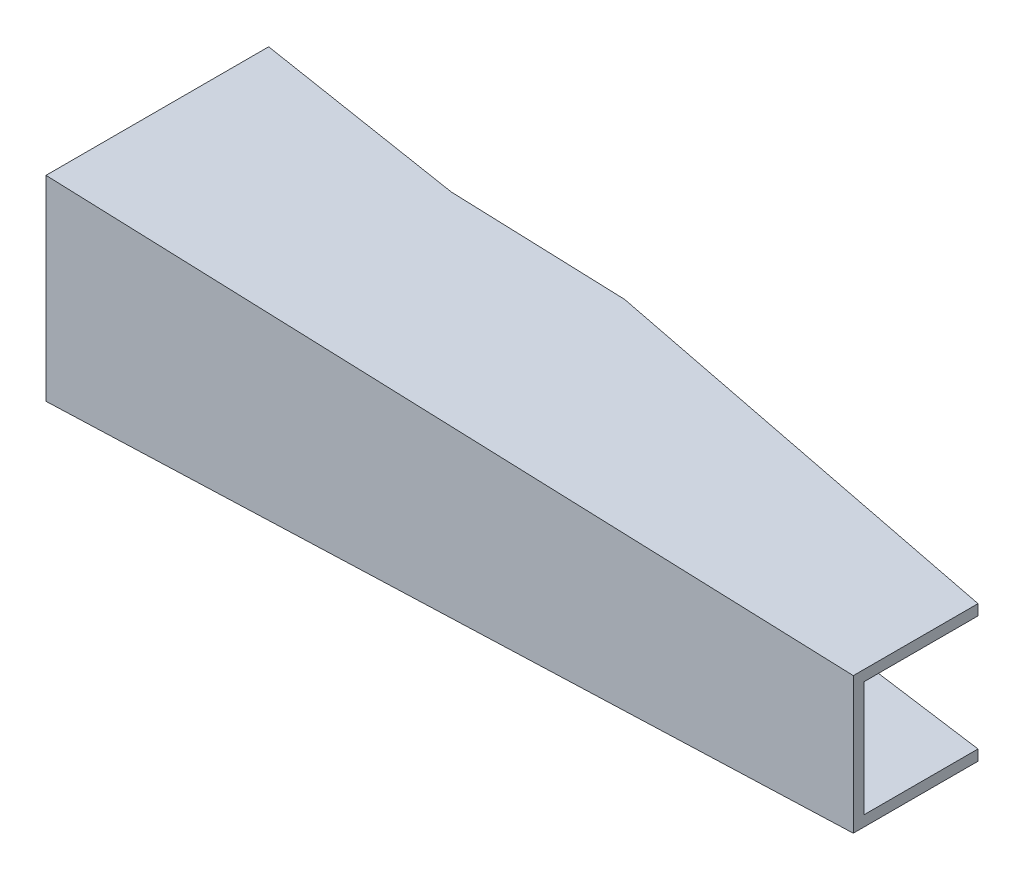
ISO-10303-21;
HEADER;
FILE_DESCRIPTION(('STEP AP214'),'2;1');
FILE_NAME('part.step','',(''),(''),'','','');
FILE_SCHEMA(('AUTOMOTIVE_DESIGN { 1 0 10303 214 1 1 1 1 }'));
ENDSEC;
DATA;
#1=APPLICATION_CONTEXT('core data for automotive mechanical design processes');
#2=APPLICATION_PROTOCOL_DEFINITION('international standard','automotive_design',2000,#1);
#3=PRODUCT_CONTEXT('',#1,'mechanical');
#4=PRODUCT('Part','Part','',(#3));
#5=PRODUCT_RELATED_PRODUCT_CATEGORY('part','',(#4));
#6=PRODUCT_DEFINITION_FORMATION('','',#4);
#7=PRODUCT_DEFINITION_CONTEXT('part definition',#1,'design');
#8=PRODUCT_DEFINITION('design','',#6,#7);
#9=PRODUCT_DEFINITION_SHAPE('','',#8);
#10=(LENGTH_UNIT() NAMED_UNIT(*) SI_UNIT(.MILLI.,.METRE.));
#11=(NAMED_UNIT(*) PLANE_ANGLE_UNIT() SI_UNIT($,.RADIAN.));
#12=(NAMED_UNIT(*) SI_UNIT($,.STERADIAN.) SOLID_ANGLE_UNIT());
#13=UNCERTAINTY_MEASURE_WITH_UNIT(LENGTH_MEASURE(1.E-05),#10,'distance_accuracy_value','');
#14=(GEOMETRIC_REPRESENTATION_CONTEXT(3) GLOBAL_UNCERTAINTY_ASSIGNED_CONTEXT((#13)) GLOBAL_UNIT_ASSIGNED_CONTEXT((#10,
#11,#12)) REPRESENTATION_CONTEXT('',''));
#15=CARTESIAN_POINT('',(0.,0.,0.));
#16=DIRECTION('',(0.,0.,1.));
#17=DIRECTION('',(1.,0.,0.));
#18=AXIS2_PLACEMENT_3D('',#15,#16,#17);
#19=CARTESIAN_POINT('',(326.3,-27.585,105.));
#20=DIRECTION('',(-1.,0.,0.));
#21=DIRECTION('',(0.,0.,1.));
#22=AXIS2_PLACEMENT_3D('',#19,#20,#21);
#23=PLANE('',#22);
#24=DIRECTION('',(0.,0.,1.));
#25=VECTOR('',#24,1.);
#26=CARTESIAN_POINT('',(326.3,23.285,100.7));
#27=LINE('',#26,#25);
#28=CARTESIAN_POINT('',(326.3,23.285,54.6));
#29=VERTEX_POINT('',#28);
#30=CARTESIAN_POINT('',(326.3,23.285,100.7));
#31=VERTEX_POINT('',#30);
#32=EDGE_CURVE('E138',#29,#31,#27,.T.);
#33=ORIENTED_EDGE('',*,*,#32,.F.);
#34=DIRECTION('',(0.,-1.,0.));
#35=VECTOR('',#34,1.);
#36=CARTESIAN_POINT('',(326.3,105.1,54.6));
#37=LINE('',#36,#35);
#38=CARTESIAN_POINT('',(326.3,27.585,54.6));
#39=VERTEX_POINT('',#38);
#40=EDGE_CURVE('E222',#39,#29,#37,.T.);
#41=ORIENTED_EDGE('',*,*,#40,.F.);
#42=DIRECTION('',(0.,0.,-1.));
#43=VECTOR('',#42,1.);
#44=CARTESIAN_POINT('',(326.3,27.585,105.));
#45=LINE('',#44,#43);
#46=CARTESIAN_POINT('',(326.3,27.585,105.));
#47=VERTEX_POINT('',#46);
#48=EDGE_CURVE('E211',#47,#39,#45,.T.);
#49=ORIENTED_EDGE('',*,*,#48,.F.);
#50=DIRECTION('',(0.,1.,0.));
#51=VECTOR('',#50,1.);
#52=CARTESIAN_POINT('',(326.3,-27.585,105.));
#53=LINE('',#52,#51);
#54=CARTESIAN_POINT('',(326.3,-27.585,105.));
#55=VERTEX_POINT('',#54);
#56=EDGE_CURVE('E193',#55,#47,#53,.T.);
#57=ORIENTED_EDGE('',*,*,#56,.F.);
#58=DIRECTION('',(0.,0.,-1.));
#59=VECTOR('',#58,1.);
#60=CARTESIAN_POINT('',(326.3,-27.585,105.));
#61=LINE('',#60,#59);
#62=CARTESIAN_POINT('',(326.3,-27.585,54.6));
#63=VERTEX_POINT('',#62);
#64=EDGE_CURVE('E202',#55,#63,#61,.T.);
#65=ORIENTED_EDGE('',*,*,#64,.T.);
#66=CARTESIAN_POINT('',(326.3,-23.285,54.6));
#67=VERTEX_POINT('',#66);
#68=EDGE_CURVE('E71',#67,#63,#37,.T.);
#69=ORIENTED_EDGE('',*,*,#68,.F.);
#70=DIRECTION('',(0.,0.,-1.));
#71=VECTOR('',#70,1.);
#72=CARTESIAN_POINT('',(326.3,-23.285,100.7));
#73=LINE('',#72,#71);
#74=CARTESIAN_POINT('',(326.3,-23.285,100.7));
#75=VERTEX_POINT('',#74);
#76=EDGE_CURVE('E64',#75,#67,#73,.T.);
#77=ORIENTED_EDGE('',*,*,#76,.F.);
#78=DIRECTION('',(0.,-1.,0.));
#79=VECTOR('',#78,1.);
#80=CARTESIAN_POINT('',(326.3,23.285,100.7));
#81=LINE('',#80,#79);
#82=EDGE_CURVE('E151',#31,#75,#81,.T.);
#83=ORIENTED_EDGE('',*,*,#82,.F.);
#84=EDGE_LOOP('',(#33,#41,#49,#57,#65,#69,#77,#83));
#85=FACE_BOUND('',#84,.T.);
#86=ADVANCED_FACE('F48',(#85),#23,.F.);
#87=CARTESIAN_POINT('',(0.,39.555,105.));
#88=DIRECTION('',(1.,0.,0.));
#89=DIRECTION('',(0.,1.,0.));
#90=AXIS2_PLACEMENT_3D('',#87,#88,#89);
#91=PLANE('',#90);
#92=DIRECTION('',(0.,0.,-1.));
#93=VECTOR('',#92,1.);
#94=CARTESIAN_POINT('',(0.,35.255,-10.9565275072));
#95=LINE('',#94,#93);
#96=CARTESIAN_POINT('',(0.,35.255,100.7));
#97=VERTEX_POINT('',#96);
#98=CARTESIAN_POINT('',(0.,35.255,15.));
#99=VERTEX_POINT('',#98);
#100=EDGE_CURVE('E166',#97,#99,#95,.T.);
#101=ORIENTED_EDGE('',*,*,#100,.F.);
#102=DIRECTION('',(0.,1.,0.));
#103=VECTOR('',#102,1.);
#104=CARTESIAN_POINT('',(0.,35.255,100.7));
#105=LINE('',#104,#103);
#106=CARTESIAN_POINT('',(0.,-35.255,100.7));
#107=VERTEX_POINT('',#106);
#108=EDGE_CURVE('E153',#107,#97,#105,.T.);
#109=ORIENTED_EDGE('',*,*,#108,.F.);
#110=DIRECTION('',(0.,0.,1.));
#111=VECTOR('',#110,1.);
#112=CARTESIAN_POINT('',(0.,-35.255,-10.9565275072));
#113=LINE('',#112,#111);
#114=CARTESIAN_POINT('',(0.,-35.255,15.));
#115=VERTEX_POINT('',#114);
#116=EDGE_CURVE('E172',#115,#107,#113,.T.);
#117=ORIENTED_EDGE('',*,*,#116,.F.);
#118=DIRECTION('',(0.,-1.,0.));
#119=VECTOR('',#118,1.);
#120=CARTESIAN_POINT('',(0.,105.1,15.));
#121=LINE('',#120,#119);
#122=CARTESIAN_POINT('',(0.,-39.555,15.));
#123=VERTEX_POINT('',#122);
#124=EDGE_CURVE('E176',#115,#123,#121,.T.);
#125=ORIENTED_EDGE('',*,*,#124,.T.);
#126=DIRECTION('',(0.,0.,-1.));
#127=VECTOR('',#126,1.);
#128=CARTESIAN_POINT('',(0.,-39.555,105.));
#129=LINE('',#128,#127);
#130=CARTESIAN_POINT('',(0.,-39.555,105.));
#131=VERTEX_POINT('',#130);
#132=EDGE_CURVE('E205',#131,#123,#129,.T.);
#133=ORIENTED_EDGE('',*,*,#132,.F.);
#134=DIRECTION('',(0.,-1.,0.));
#135=VECTOR('',#134,1.);
#136=CARTESIAN_POINT('',(0.,39.555,105.));
#137=LINE('',#136,#135);
#138=CARTESIAN_POINT('',(0.,39.555,105.));
#139=VERTEX_POINT('',#138);
#140=EDGE_CURVE('E198',#139,#131,#137,.T.);
#141=ORIENTED_EDGE('',*,*,#140,.F.);
#142=DIRECTION('',(0.,0.,-1.));
#143=VECTOR('',#142,1.);
#144=CARTESIAN_POINT('',(0.,39.555,105.));
#145=LINE('',#144,#143);
#146=CARTESIAN_POINT('',(0.,39.555,15.));
#147=VERTEX_POINT('',#146);
#148=EDGE_CURVE('E208',#139,#147,#145,.T.);
#149=ORIENTED_EDGE('',*,*,#148,.T.);
#150=EDGE_CURVE('E179',#147,#99,#121,.T.);
#151=ORIENTED_EDGE('',*,*,#150,.T.);
#152=EDGE_LOOP('',(#101,#109,#117,#125,#133,#141,#149,#151));
#153=FACE_BOUND('',#152,.T.);
#154=ADVANCED_FACE('F273',(#153),#91,.F.);
#155=CARTESIAN_POINT('',(0.,105.1,15.));
#156=DIRECTION('',(0.126715247143414,0.,-0.991939134292716));
#157=DIRECTION('',(-0.991939134292716,0.,-0.126715247143414));
#158=AXIS2_PLACEMENT_3D('',#155,#156,#157);
#159=PLANE('',#158);
#160=DIRECTION('',(0.,-1.,0.));
#161=VECTOR('',#160,1.);
#162=CARTESIAN_POINT('',(84.7,105.1,25.82));
#163=LINE('',#162,#161);
#164=CARTESIAN_POINT('',(84.7,36.4478623965676,25.82));
#165=VERTEX_POINT('',#164);
#166=CARTESIAN_POINT('',(84.7,32.1478623965676,25.82));
#167=VERTEX_POINT('',#166);
#168=EDGE_CURVE('E180',#165,#167,#163,.T.);
#169=ORIENTED_EDGE('',*,*,#168,.T.);
#170=DIRECTION('',(-0.991283067279321,0.036364260849934,-0.126631437874407));
#171=VECTOR('',#170,1.);
#172=CARTESIAN_POINT('',(-2.51772199464138,35.3473601969839,14.6783736483823));
#173=LINE('',#172,#171);
#174=EDGE_CURVE('E259',#167,#99,#173,.T.);
#175=ORIENTED_EDGE('',*,*,#174,.T.);
#176=ORIENTED_EDGE('',*,*,#150,.F.);
#177=DIRECTION('',(0.991283067279321,-0.036364260849934,0.126631437874407));
#178=VECTOR('',#177,1.);
#179=CARTESIAN_POINT('',(332.365093492241,27.3625079095859,57.4579729821257));
#180=LINE('',#179,#178);
#181=EDGE_CURVE('E191',#147,#165,#180,.T.);
#182=ORIENTED_EDGE('',*,*,#181,.T.);
#183=EDGE_LOOP('',(#169,#175,#176,#182));
#184=FACE_BOUND('',#183,.T.);
#185=ADVANCED_FACE('F269',(#184),#159,.T.);
#186=ORIENTED_EDGE('',*,*,#124,.F.);
#187=DIRECTION('',(0.991283067279321,0.036364260849934,0.126631437874407));
#188=VECTOR('',#187,1.);
#189=CARTESIAN_POINT('',(5.05941542784582,-35.0694002369865,15.6463149342301));
#190=LINE('',#189,#188);
#191=CARTESIAN_POINT('',(84.7,-32.1478623965676,25.82));
#192=VERTEX_POINT('',#191);
#193=EDGE_CURVE('E255',#115,#192,#190,.T.);
#194=ORIENTED_EDGE('',*,*,#193,.T.);
#195=CARTESIAN_POINT('',(84.7,-36.4478623965676,25.82));
#196=VERTEX_POINT('',#195);
#197=EDGE_CURVE('E234',#192,#196,#163,.T.);
#198=ORIENTED_EDGE('',*,*,#197,.T.);
#199=DIRECTION('',(-0.991283067279321,-0.036364260849934,-0.126631437874407));
#200=VECTOR('',#199,1.);
#201=CARTESIAN_POINT('',(11.297484013512,-39.14056272252,16.4431968952326));
#202=LINE('',#201,#200);
#203=EDGE_CURVE('E219',#196,#123,#202,.T.);
#204=ORIENTED_EDGE('',*,*,#203,.T.);
#205=EDGE_LOOP('',(#186,#194,#198,#204));
#206=FACE_BOUND('',#205,.T.);
#207=ADVANCED_FACE('F253',(#206),#159,.T.);
#208=CARTESIAN_POINT('',(84.7,105.1,25.82));
#209=DIRECTION('',(0.,0.,-1.));
#210=DIRECTION('',(-1.,0.,0.));
#211=AXIS2_PLACEMENT_3D('',#208,#209,#210);
#212=PLANE('',#211);
#213=DIRECTION('',(0.,-1.,0.));
#214=VECTOR('',#213,1.);
#215=CARTESIAN_POINT('',(154.7,105.1,25.82));
#216=LINE('',#215,#214);
#217=CARTESIAN_POINT('',(154.7,33.8799800796813,25.82));
#218=VERTEX_POINT('',#217);
#219=CARTESIAN_POINT('',(154.7,29.5799800796813,25.82));
#220=VERTEX_POINT('',#219);
#221=EDGE_CURVE('E231',#218,#220,#216,.T.);
#222=ORIENTED_EDGE('',*,*,#221,.T.);
#223=DIRECTION('',(-0.999327819206277,0.0366593747958907,0.));
#224=VECTOR('',#223,1.);
#225=CARTESIAN_POINT('',(82.0274179121405,32.2459034863367,25.82));
#226=LINE('',#225,#224);
#227=EDGE_CURVE('E257',#220,#167,#226,.T.);
#228=ORIENTED_EDGE('',*,*,#227,.T.);
#229=ORIENTED_EDGE('',*,*,#168,.F.);
#230=DIRECTION('',(0.999327819206278,-0.0366593747958907,0.));
#231=VECTOR('',#230,1.);
#232=CARTESIAN_POINT('',(326.3,27.585,25.82));
#233=LINE('',#232,#231);
#234=EDGE_CURVE('E189',#165,#218,#233,.T.);
#235=ORIENTED_EDGE('',*,*,#234,.T.);
#236=EDGE_LOOP('',(#222,#228,#229,#235));
#237=FACE_BOUND('',#236,.T.);
#238=ADVANCED_FACE('F280',(#237),#212,.T.);
#239=ORIENTED_EDGE('',*,*,#197,.F.);
#240=DIRECTION('',(0.999327819206278,0.0366593747958907,0.));
#241=VECTOR('',#240,1.);
#242=CARTESIAN_POINT('',(89.7280388030852,-31.9634136546953,25.82));
#243=LINE('',#242,#241);
#244=CARTESIAN_POINT('',(154.7,-29.5799800796813,25.82));
#245=VERTEX_POINT('',#244);
#246=EDGE_CURVE('E168',#192,#245,#243,.T.);
#247=ORIENTED_EDGE('',*,*,#246,.T.);
#248=CARTESIAN_POINT('',(154.7,-33.8799800796813,25.82));
#249=VERTEX_POINT('',#248);
#250=EDGE_CURVE('E225',#245,#249,#216,.T.);
#251=ORIENTED_EDGE('',*,*,#250,.T.);
#252=DIRECTION('',(-0.999327819206278,-0.0366593747958907,0.));
#253=VECTOR('',#252,1.);
#254=CARTESIAN_POINT('',(0.,-39.555,25.82));
#255=LINE('',#254,#253);
#256=EDGE_CURVE('E216',#249,#196,#255,.T.);
#257=ORIENTED_EDGE('',*,*,#256,.T.);
#258=EDGE_LOOP('',(#239,#247,#251,#257));
#259=FACE_BOUND('',#258,.T.);
#260=ADVANCED_FACE('F242',(#259),#212,.T.);
#261=CARTESIAN_POINT('',(154.7,105.1,25.82));
#262=DIRECTION('',(0.165405444621505,0.,-0.986225653128919));
#263=DIRECTION('',(-0.986225653128919,0.,-0.165405444621505));
#264=AXIS2_PLACEMENT_3D('',#261,#262,#263);
#265=PLANE('',#264);
#266=ORIENTED_EDGE('',*,*,#40,.T.);
#267=DIRECTION('',(-0.985580850259129,0.0361550805320312,-0.165297301109894));
#268=VECTOR('',#267,1.);
#269=CARTESIAN_POINT('',(152.008938111662,29.6786990830628,25.3686668930864));
#270=LINE('',#269,#268);
#271=EDGE_CURVE('E12',#29,#220,#270,.T.);
#272=ORIENTED_EDGE('',*,*,#271,.T.);
#273=ORIENTED_EDGE('',*,*,#221,.F.);
#274=DIRECTION('',(0.985580850259129,-0.0361550805320312,0.165297301109894));
#275=VECTOR('',#274,1.);
#276=CARTESIAN_POINT('',(334.510858270501,27.2837926034389,55.9770891668124));
#277=LINE('',#276,#275);
#278=EDGE_CURVE('E186',#218,#39,#277,.T.);
#279=ORIENTED_EDGE('',*,*,#278,.T.);
#280=EDGE_LOOP('',(#266,#272,#273,#279));
#281=FACE_BOUND('',#280,.T.);
#282=ADVANCED_FACE('F282',(#281),#265,.T.);
#283=ORIENTED_EDGE('',*,*,#250,.F.);
#284=DIRECTION('',(0.985580850259129,0.0361550805320312,0.165297301109894));
#285=VECTOR('',#284,1.);
#286=CARTESIAN_POINT('',(159.499153415173,-29.4039277769549,26.6248929795378));
#287=LINE('',#286,#285);
#288=EDGE_CURVE('E56',#245,#67,#287,.T.);
#289=ORIENTED_EDGE('',*,*,#288,.T.);
#290=ORIENTED_EDGE('',*,*,#68,.T.);
#291=DIRECTION('',(-0.985580850259129,-0.0361550805320312,-0.165297301109894));
#292=VECTOR('',#291,1.);
#293=CARTESIAN_POINT('',(17.1264176977011,-38.9267339263209,2.74676166281956));
#294=LINE('',#293,#292);
#295=EDGE_CURVE('E214',#63,#249,#294,.T.);
#296=ORIENTED_EDGE('',*,*,#295,.T.);
#297=EDGE_LOOP('',(#283,#289,#290,#296));
#298=FACE_BOUND('',#297,.T.);
#299=ADVANCED_FACE('F245',(#298),#265,.T.);
#300=CARTESIAN_POINT('',(326.3,27.585,105.));
#301=DIRECTION('',(-0.0366593747958907,-0.999327819206278,0.));
#302=DIRECTION('',(0.999327819206278,-0.0366593747958907,0.));
#303=AXIS2_PLACEMENT_3D('',#300,#301,#302);
#304=PLANE('',#303);
#305=ORIENTED_EDGE('',*,*,#181,.F.);
#306=ORIENTED_EDGE('',*,*,#148,.F.);
#307=DIRECTION('',(-0.999327819206278,0.0366593747958907,0.));
#308=VECTOR('',#307,1.);
#309=CARTESIAN_POINT('',(326.3,27.585,105.));
#310=LINE('',#309,#308);
#311=EDGE_CURVE('E196',#47,#139,#310,.T.);
#312=ORIENTED_EDGE('',*,*,#311,.F.);
#313=ORIENTED_EDGE('',*,*,#48,.T.);
#314=ORIENTED_EDGE('',*,*,#278,.F.);
#315=ORIENTED_EDGE('',*,*,#234,.F.);
#316=EDGE_LOOP('',(#305,#306,#312,#313,#314,#315));
#317=FACE_BOUND('',#316,.T.);
#318=ADVANCED_FACE('F277',(#317),#304,.F.);
#319=CARTESIAN_POINT('',(0.,-39.555,105.));
#320=DIRECTION('',(-0.0366593747958907,0.999327819206278,0.));
#321=DIRECTION('',(-0.999327819206278,-0.0366593747958907,0.));
#322=AXIS2_PLACEMENT_3D('',#319,#320,#321);
#323=PLANE('',#322);
#324=ORIENTED_EDGE('',*,*,#203,.F.);
#325=ORIENTED_EDGE('',*,*,#256,.F.);
#326=ORIENTED_EDGE('',*,*,#295,.F.);
#327=ORIENTED_EDGE('',*,*,#64,.F.);
#328=DIRECTION('',(0.999327819206278,0.0366593747958907,0.));
#329=VECTOR('',#328,1.);
#330=CARTESIAN_POINT('',(0.,-39.555,105.));
#331=LINE('',#330,#329);
#332=EDGE_CURVE('E200',#131,#55,#331,.T.);
#333=ORIENTED_EDGE('',*,*,#332,.F.);
#334=ORIENTED_EDGE('',*,*,#132,.T.);
#335=EDGE_LOOP('',(#324,#325,#326,#327,#333,#334));
#336=FACE_BOUND('',#335,.T.);
#337=ADVANCED_FACE('F248',(#336),#323,.F.);
#338=CARTESIAN_POINT('',(0.,0.,105.));
#339=DIRECTION('',(0.,0.,1.));
#340=DIRECTION('',(1.,0.,0.));
#341=AXIS2_PLACEMENT_3D('',#338,#339,#340);
#342=PLANE('',#341);
#343=ORIENTED_EDGE('',*,*,#56,.T.);
#344=ORIENTED_EDGE('',*,*,#311,.T.);
#345=ORIENTED_EDGE('',*,*,#140,.T.);
#346=ORIENTED_EDGE('',*,*,#332,.T.);
#347=EDGE_LOOP('',(#343,#344,#345,#346));
#348=FACE_BOUND('',#347,.T.);
#349=ADVANCED_FACE('F286',(#348),#342,.T.);
#350=CARTESIAN_POINT('',(1.29155751432091,35.2076204613962,0.));
#351=DIRECTION('',(-0.0366593747958907,-0.999327819206277,0.));
#352=DIRECTION('',(0.999327819206277,-0.0366593747958907,0.));
#353=AXIS2_PLACEMENT_3D('',#350,#351,#352);
#354=PLANE('',#353);
#355=ORIENTED_EDGE('',*,*,#227,.F.);
#356=ORIENTED_EDGE('',*,*,#271,.F.);
#357=ORIENTED_EDGE('',*,*,#32,.T.);
#358=DIRECTION('',(-0.999327819206278,0.0366593747958907,0.));
#359=VECTOR('',#358,1.);
#360=CARTESIAN_POINT('',(326.3,23.285,100.7));
#361=LINE('',#360,#359);
#362=EDGE_CURVE('E141',#31,#97,#361,.T.);
#363=ORIENTED_EDGE('',*,*,#362,.T.);
#364=ORIENTED_EDGE('',*,*,#100,.T.);
#365=ORIENTED_EDGE('',*,*,#174,.F.);
#366=EDGE_LOOP('',(#355,#356,#357,#363,#364,#365));
#367=FACE_BOUND('',#366,.T.);
#368=ADVANCED_FACE('F140',(#367),#354,.T.);
#369=CARTESIAN_POINT('',(0.,0.,100.7));
#370=DIRECTION('',(0.,0.,-1.));
#371=DIRECTION('',(0.,1.,0.));
#372=AXIS2_PLACEMENT_3D('',#369,#370,#371);
#373=PLANE('',#372);
#374=ORIENTED_EDGE('',*,*,#362,.F.);
#375=ORIENTED_EDGE('',*,*,#82,.T.);
#376=DIRECTION('',(-0.999327819206278,-0.0366593747958907,0.));
#377=VECTOR('',#376,1.);
#378=CARTESIAN_POINT('',(326.3,-23.285,100.7));
#379=LINE('',#378,#377);
#380=EDGE_CURVE('E155',#75,#107,#379,.T.);
#381=ORIENTED_EDGE('',*,*,#380,.T.);
#382=ORIENTED_EDGE('',*,*,#108,.T.);
#383=EDGE_LOOP('',(#374,#375,#381,#382));
#384=FACE_BOUND('',#383,.T.);
#385=ADVANCED_FACE('F149',(#384),#373,.T.);
#386=CARTESIAN_POINT('',(1.29155751432091,-35.2076204613962,0.));
#387=DIRECTION('',(-0.0366593747958907,0.999327819206278,0.));
#388=DIRECTION('',(-0.999327819206278,-0.0366593747958907,0.));
#389=AXIS2_PLACEMENT_3D('',#386,#387,#388);
#390=PLANE('',#389);
#391=ORIENTED_EDGE('',*,*,#116,.T.);
#392=ORIENTED_EDGE('',*,*,#380,.F.);
#393=ORIENTED_EDGE('',*,*,#76,.T.);
#394=ORIENTED_EDGE('',*,*,#288,.F.);
#395=ORIENTED_EDGE('',*,*,#246,.F.);
#396=ORIENTED_EDGE('',*,*,#193,.F.);
#397=EDGE_LOOP('',(#391,#392,#393,#394,#395,#396));
#398=FACE_BOUND('',#397,.T.);
#399=ADVANCED_FACE('F287',(#398),#390,.T.);
#400=CLOSED_SHELL('',(#86,#154,#185,#207,#238,#260,#282,#299,#318,#337,#349,#368,#385,#399));
#401=MANIFOLD_SOLID_BREP('B2',#400);
#402=ADVANCED_BREP_SHAPE_REPRESENTATION('',(#18,#401),#14);
#403=SHAPE_DEFINITION_REPRESENTATION(#9,#402);
ENDSEC;
END-ISO-10303-21;
